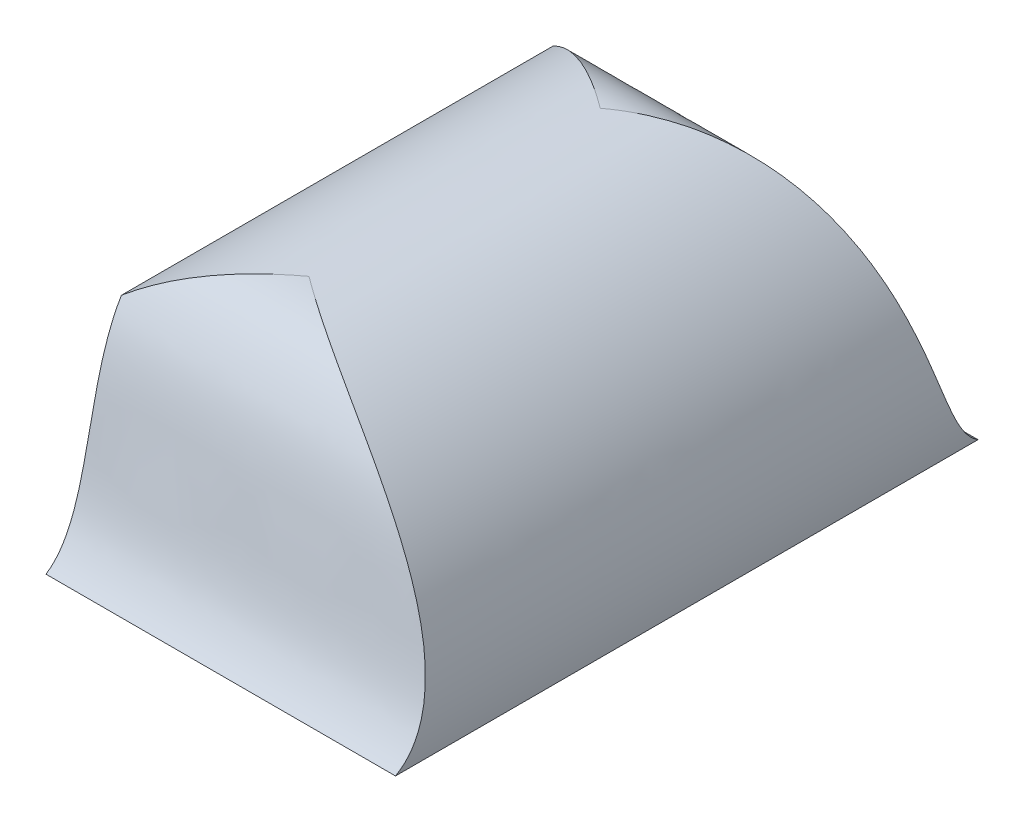
ISO-10303-21;
HEADER;
FILE_DESCRIPTION(('STEP AP214'),'2;1');
FILE_NAME('part.step','',(''),(''),'','','');
FILE_SCHEMA(('AUTOMOTIVE_DESIGN { 1 0 10303 214 1 1 1 1 }'));
ENDSEC;
DATA;
#1=APPLICATION_CONTEXT('core data for automotive mechanical design processes');
#2=APPLICATION_PROTOCOL_DEFINITION('international standard','automotive_design',2000,#1);
#3=PRODUCT_CONTEXT('',#1,'mechanical');
#4=PRODUCT('Part','Part','',(#3));
#5=PRODUCT_RELATED_PRODUCT_CATEGORY('part','',(#4));
#6=PRODUCT_DEFINITION_FORMATION('','',#4);
#7=PRODUCT_DEFINITION_CONTEXT('part definition',#1,'design');
#8=PRODUCT_DEFINITION('design','',#6,#7);
#9=PRODUCT_DEFINITION_SHAPE('','',#8);
#10=(LENGTH_UNIT() NAMED_UNIT(*) SI_UNIT(.MILLI.,.METRE.));
#11=(NAMED_UNIT(*) PLANE_ANGLE_UNIT() SI_UNIT($,.RADIAN.));
#12=(NAMED_UNIT(*) SI_UNIT($,.STERADIAN.) SOLID_ANGLE_UNIT());
#13=UNCERTAINTY_MEASURE_WITH_UNIT(LENGTH_MEASURE(1.E-05),#10,'distance_accuracy_value','');
#14=(GEOMETRIC_REPRESENTATION_CONTEXT(3) GLOBAL_UNCERTAINTY_ASSIGNED_CONTEXT((#13)) GLOBAL_UNIT_ASSIGNED_CONTEXT((#10,
#11,#12)) REPRESENTATION_CONTEXT('',''));
#15=CARTESIAN_POINT('',(0.,0.,0.));
#16=DIRECTION('',(0.,0.,1.));
#17=DIRECTION('',(1.,0.,0.));
#18=AXIS2_PLACEMENT_3D('',#15,#16,#17);
#19=CARTESIAN_POINT('',(0.6,0.,0.25));
#20=CARTESIAN_POINT('',(0.626819788030723,0.289928397578695,0.25));
#21=CARTESIAN_POINT('',(0.257985515738042,0.545390799762338,0.25));
#22=CARTESIAN_POINT('',(0.,0.35,0.25));
#23=B_SPLINE_CURVE_WITH_KNOTS('',3,(#19,#20,#21,#22),.UNSPECIFIED.,.F.,.F.,(4,4),(0.,1.),.UNSPECIFIED.);
#24=DIRECTION('',(0.,0.,-1.));
#25=VECTOR('',#24,1.);
#26=SURFACE_OF_LINEAR_EXTRUSION('',#23,#25);
#27=DIRECTION('',(0.,0.,-1.));
#28=VECTOR('',#27,1.);
#29=CARTESIAN_POINT('',(0.,0.35,0.25));
#30=LINE('',#29,#28);
#31=CARTESIAN_POINT('',(0.,0.349999999403882,0.370521911412625));
#32=VERTEX_POINT('',#31);
#33=CARTESIAN_POINT('',(0.,0.35,-0.370521911412625));
#34=VERTEX_POINT('',#33);
#35=EDGE_CURVE('E48',#32,#34,#30,.T.);
#36=ORIENTED_EDGE('',*,*,#35,.F.);
#37=CARTESIAN_POINT('',(0.,0.349999999999997,0.370521911049339));
#38=CARTESIAN_POINT('',(0.00825527885618861,0.356255849450693,0.366712872777325));
#39=CARTESIAN_POINT('',(0.01670774569311,0.362105432406488,0.362678678142125));
#40=CARTESIAN_POINT('',(0.0339234244274184,0.372950656876308,0.354163679151032));
#41=CARTESIAN_POINT('',(0.0426864991470208,0.377946669826716,0.349683070405773));
#42=CARTESIAN_POINT('',(0.0692006872566339,0.391535029749839,0.335639015499935));
#43=CARTESIAN_POINT('',(0.0872968181289452,0.398817946316962,0.325418908973627));
#44=CARTESIAN_POINT('',(0.121098640930965,0.409136187235741,0.305036802703458));
#45=CARTESIAN_POINT('',(0.136788344406358,0.412620049119834,0.29506273608286));
#46=CARTESIAN_POINT('',(0.167911899364637,0.417252919245855,0.274235900732327));
#47=CARTESIAN_POINT('',(0.183345927724373,0.418403614738341,0.263383772890552));
#48=CARTESIAN_POINT('',(0.199505616780379,0.418544612505018,0.251466641467701));
#49=CARTESIAN_POINT('',(0.2004959868034,0.418548912358348,0.250734018721069));
#50=CARTESIAN_POINT('',(0.20148518074984,0.418548901834156,0.25));
#51=B_SPLINE_CURVE_WITH_KNOTS('',3,(#37,#38,#39,#40,#41,#42,#43,#44,#45,#46,#47,#48,#49,#50),
.UNSPECIFIED.,.F.,.F.,(4,2,2,2,2,2,4),(0.,0.0330862202839932,0.0661580060149827,
0.131829646521694,0.188407274208213,0.244943972653786,0.248639634344501),.UNSPECIFIED.);
#52=CARTESIAN_POINT('',(0.201485180749996,0.418548901834156,0.25));
#53=VERTEX_POINT('',#52);
#54=EDGE_CURVE('E77',#32,#53,#51,.T.);
#55=ORIENTED_EDGE('',*,*,#54,.T.);
#56=CARTESIAN_POINT('',(0.6,0.,0.5));
#57=CARTESIAN_POINT('',(0.600309456843271,0.00328595093172608,0.494965112052997));
#58=CARTESIAN_POINT('',(0.600610500159222,0.00713623887497123,0.490374210968532));
#59=CARTESIAN_POINT('',(0.601089507162062,0.0155632954519763,0.482064447642185));
#60=CARTESIAN_POINT('',(0.601269609789353,0.0201255775204056,0.47833124373096));
#61=CARTESIAN_POINT('',(0.601454954538251,0.0320253042292035,0.469911865294647));
#62=CARTESIAN_POINT('',(0.601334354444628,0.0396417637507074,0.465631526865669));
#63=CARTESIAN_POINT('',(0.600497506607325,0.0553849172072791,0.458063979399536));
#64=CARTESIAN_POINT('',(0.599775335927399,0.0635159388713859,0.454787090636494));
#65=CARTESIAN_POINT('',(0.596748385181316,0.0872787410461483,0.446276502410716));
#66=CARTESIAN_POINT('',(0.593605748882381,0.103113037235993,0.441914948246667));
#67=CARTESIAN_POINT('',(0.5850967919933,0.134370708740922,0.43422445179017));
#68=CARTESIAN_POINT('',(0.579731364935154,0.149794246526878,0.430895095507223));
#69=CARTESIAN_POINT('',(0.564450389619757,0.185923664821895,0.423273653674747));
#70=CARTESIAN_POINT('',(0.553572727417092,0.206259340928663,0.419132877391412));
#71=CARTESIAN_POINT('',(0.528627154892707,0.244755632950418,0.410362891631758));
#72=CARTESIAN_POINT('',(0.514555513806971,0.262913667032004,0.405733114380721));
#73=CARTESIAN_POINT('',(0.483760308356701,0.296816735105153,0.395298023187908));
#74=CARTESIAN_POINT('',(0.467009350638104,0.312533119150924,0.389480372983261));
#75=CARTESIAN_POINT('',(0.431674713054268,0.34095582958504,0.376272103483193));
#76=CARTESIAN_POINT('',(0.413091112238233,0.353662285723215,0.368881552017362));
#77=CARTESIAN_POINT('',(0.37410456686757,0.37618621593128,0.351965538274795));
#78=CARTESIAN_POINT('',(0.353659961186571,0.385881205949137,0.342371952666841));
#79=CARTESIAN_POINT('',(0.312432573313025,0.401528263512743,0.321154569651431));
#80=CARTESIAN_POINT('',(0.291650113315865,0.407483704514568,0.309532614173704));
#81=CARTESIAN_POINT('',(0.248455423708947,0.416086356109303,0.283111456839611));
#82=CARTESIAN_POINT('',(0.226085830064731,0.418347151703636,0.268111510903899));
#83=CARTESIAN_POINT('',(0.203465071608549,0.418544642715857,0.251466128242887));
#84=CARTESIAN_POINT('',(0.202474322305935,0.418548944688426,0.250734015315585));
#85=CARTESIAN_POINT('',(0.20148518074984,0.418548901834156,0.25));
#86=B_SPLINE_CURVE_WITH_KNOTS('',3,(#56,#57,#58,#59,#60,#61,#62,#63,#64,#65,#66,#67,#68,#69,#70,
#71,#72,#73,#74,#75,#76,#77,#78,#79,#80,#81,#82,#83,#84,#85),.UNSPECIFIED.,.F.,.F.,(4,2,2,2,2,2,
2,2,2,2,2,2,2,2,4),(0.,0.0179271297373814,0.0355282081543646,0.0615987211301575,
0.0879289952653558,0.137815573256445,0.187682116942603,0.257603420179295,0.327606819977274,
0.398378012167399,0.469146153047947,0.542499334026183,0.615786247498508,0.696337234710239,
0.700032899617386),.UNSPECIFIED.);
#87=CARTESIAN_POINT('',(0.6,0.,0.5));
#88=VERTEX_POINT('',#87);
#89=EDGE_CURVE('E79',#53,#88,#86,.F.);
#90=ORIENTED_EDGE('',*,*,#89,.T.);
#91=DIRECTION('',(0.,0.,-1.));
#92=VECTOR('',#91,1.);
#93=CARTESIAN_POINT('',(0.6,0.,0.25));
#94=LINE('',#93,#92);
#95=CARTESIAN_POINT('',(0.6,0.,-0.5));
#96=VERTEX_POINT('',#95);
#97=EDGE_CURVE('E89',#88,#96,#94,.T.);
#98=ORIENTED_EDGE('',*,*,#97,.T.);
#99=CARTESIAN_POINT('',(0.6,0.,-0.5));
#100=CARTESIAN_POINT('',(0.600309456843271,0.00328595093172607,-0.494965112052997));
#101=CARTESIAN_POINT('',(0.600610500159222,0.00713623887497124,-0.490374210968532));
#102=CARTESIAN_POINT('',(0.601089507162062,0.0155632954519763,-0.482064447642185));
#103=CARTESIAN_POINT('',(0.601269609789353,0.0201255775204056,-0.47833124373096));
#104=CARTESIAN_POINT('',(0.601454954538251,0.0320253042292035,-0.469911865294647));
#105=CARTESIAN_POINT('',(0.601334354444628,0.0396417637507074,-0.465631526865669));
#106=CARTESIAN_POINT('',(0.600497506607325,0.0553849172072791,-0.458063979399536));
#107=CARTESIAN_POINT('',(0.5997753359274,0.0635159388713859,-0.454787090636494));
#108=CARTESIAN_POINT('',(0.596748385181316,0.0872787410461483,-0.446276502410716));
#109=CARTESIAN_POINT('',(0.593605748882381,0.103113037235993,-0.441914948246667));
#110=CARTESIAN_POINT('',(0.585096791993299,0.134370708740922,-0.43422445179017));
#111=CARTESIAN_POINT('',(0.579731364935154,0.149794246526878,-0.430895095507223));
#112=CARTESIAN_POINT('',(0.564450389619757,0.185923664821896,-0.423273653674747));
#113=CARTESIAN_POINT('',(0.553572727417092,0.206259340928664,-0.419132877391411));
#114=CARTESIAN_POINT('',(0.528627154892706,0.244755632950419,-0.410362891631758));
#115=CARTESIAN_POINT('',(0.51455551380697,0.262913667032004,-0.40573311438072));
#116=CARTESIAN_POINT('',(0.4837603083567,0.296816735105154,-0.395298023187908));
#117=CARTESIAN_POINT('',(0.467009350638103,0.312533119150925,-0.389480372983261));
#118=CARTESIAN_POINT('',(0.431674713054267,0.340955829585041,-0.376272103483192));
#119=CARTESIAN_POINT('',(0.413091112238231,0.353662285723216,-0.368881552017362));
#120=CARTESIAN_POINT('',(0.374104566867568,0.376186215931281,-0.351965538274795));
#121=CARTESIAN_POINT('',(0.353659961186569,0.385881205949137,-0.342371952666839));
#122=CARTESIAN_POINT('',(0.312432573313022,0.401528263512743,-0.321154569651431));
#123=CARTESIAN_POINT('',(0.291650113315862,0.407483704514568,-0.309532614173706));
#124=CARTESIAN_POINT('',(0.248455423708948,0.416086356109303,-0.283111456839608));
#125=CARTESIAN_POINT('',(0.226085830064738,0.418347151703636,-0.268111510903888));
#126=CARTESIAN_POINT('',(0.203465071608549,0.418544642715857,-0.251466128242886));
#127=CARTESIAN_POINT('',(0.202474322305935,0.418548944688426,-0.250734015315584));
#128=CARTESIAN_POINT('',(0.20148518074984,0.418548901834156,-0.25));
#129=B_SPLINE_CURVE_WITH_KNOTS('',3,(#99,#100,#101,#102,#103,#104,#105,#106,#107,#108,#109,#110,
#111,#112,#113,#114,#115,#116,#117,#118,#119,#120,#121,#122,#123,#124,#125,#126,#127,#128),
.UNSPECIFIED.,.F.,.F.,(4,2,2,2,2,2,2,2,2,2,2,2,2,2,4),(0.,0.0179271297373815,0.0355282081543646,
0.0615987211301575,0.0879289952653557,0.137815573256446,0.187682116942604,0.257603420179296,
0.327606819977276,0.3983780121674,0.469146153047948,0.542499334026186,0.615786247498509,
0.696337234710239,0.700032899617385),.UNSPECIFIED.);
#130=CARTESIAN_POINT('',(0.201486085555685,0.418548901832957,-0.25));
#131=VERTEX_POINT('',#130);
#132=EDGE_CURVE('E121',#131,#96,#129,.F.);
#133=ORIENTED_EDGE('',*,*,#132,.F.);
#134=CARTESIAN_POINT('',(0.,0.349999999999997,-0.370521911049339));
#135=CARTESIAN_POINT('',(0.00825527885619393,0.356255849450697,-0.366712872777322));
#136=CARTESIAN_POINT('',(0.0167077456931216,0.362105432406496,-0.362678678142119));
#137=CARTESIAN_POINT('',(0.0339234244274423,0.372950656876322,-0.354163679151021));
#138=CARTESIAN_POINT('',(0.0426864991470509,0.377946669826733,-0.349683070405758));
#139=CARTESIAN_POINT('',(0.0692006872566738,0.391535029749857,-0.335639015499912));
#140=CARTESIAN_POINT('',(0.087296818128987,0.398817946316979,-0.325418908973595));
#141=CARTESIAN_POINT('',(0.121098640931009,0.409136187235751,-0.305036802703437));
#142=CARTESIAN_POINT('',(0.136788344406402,0.412620049119839,-0.295062736082856));
#143=CARTESIAN_POINT('',(0.16791189936464,0.417252919245856,-0.2742359007323));
#144=CARTESIAN_POINT('',(0.183345927724335,0.418403614738342,-0.263383772890485));
#145=CARTESIAN_POINT('',(0.199505616780374,0.418544612505018,-0.251466641467692));
#146=CARTESIAN_POINT('',(0.200495986803397,0.418548912358348,-0.250734018721065));
#147=CARTESIAN_POINT('',(0.20148518074984,0.418548901834156,-0.25));
#148=B_SPLINE_CURVE_WITH_KNOTS('',3,(#134,#135,#136,#137,#138,#139,#140,#141,#142,#143,#144,
#145,#146,#147),.UNSPECIFIED.,.F.,.F.,(4,2,2,2,2,2,4),(0.,0.0330862202840161,0.0661580060150272,
0.131829646521755,0.18840727420824,0.244943972653787,0.2486396343445),.UNSPECIFIED.);
#149=EDGE_CURVE('E11',#34,#131,#148,.T.);
#150=ORIENTED_EDGE('',*,*,#149,.F.);
#151=EDGE_LOOP('',(#36,#55,#90,#98,#133,#150));
#152=FACE_BOUND('',#151,.T.);
#153=ADVANCED_FACE('F34',(#152),#26,.F.);
#154=CARTESIAN_POINT('',(0.,0.35,0.25));
#155=DIRECTION('',(1.,0.,0.));
#156=DIRECTION('',(0.,1.,0.));
#157=AXIS2_PLACEMENT_3D('',#154,#155,#156);
#158=PLANE('',#157);
#159=CARTESIAN_POINT('',(0.,0.,0.5));
#160=CARTESIAN_POINT('',(0.,0.0714905444473845,0.390864989579389));
#161=CARTESIAN_POINT('',(0.,0.418548901834156,0.458561006871926));
#162=CARTESIAN_POINT('',(0.,0.418548901834156,0.25));
#163=B_SPLINE_CURVE_WITH_KNOTS('',3,(#159,#160,#161,#162),.UNSPECIFIED.,.F.,.F.,(4,4),(0.,1.),.UNSPECIFIED.);
#164=CARTESIAN_POINT('',(0.,0.,0.5));
#165=VERTEX_POINT('',#164);
#166=EDGE_CURVE('E93',#165,#32,#163,.T.);
#167=ORIENTED_EDGE('',*,*,#166,.T.);
#168=ORIENTED_EDGE('',*,*,#35,.T.);
#169=CARTESIAN_POINT('',(0.,0.,-0.5));
#170=CARTESIAN_POINT('',(0.,0.0714905444473845,-0.390864989579389));
#171=CARTESIAN_POINT('',(0.,0.418548901834156,-0.458561006871926));
#172=CARTESIAN_POINT('',(0.,0.418548901834156,-0.25));
#173=B_SPLINE_CURVE_WITH_KNOTS('',3,(#169,#170,#171,#172),.UNSPECIFIED.,.F.,.F.,(4,4),(0.,1.),.UNSPECIFIED.);
#174=CARTESIAN_POINT('',(0.,0.,-0.5));
#175=VERTEX_POINT('',#174);
#176=EDGE_CURVE('E84',#175,#34,#173,.T.);
#177=ORIENTED_EDGE('',*,*,#176,.F.);
#178=DIRECTION('',(0.,0.,-1.));
#179=VECTOR('',#178,1.);
#180=CARTESIAN_POINT('',(0.,0.,0.25));
#181=LINE('',#180,#179);
#182=EDGE_CURVE('E91',#165,#175,#181,.T.);
#183=ORIENTED_EDGE('',*,*,#182,.F.);
#184=EDGE_LOOP('',(#167,#168,#177,#183));
#185=FACE_BOUND('',#184,.T.);
#186=ADVANCED_FACE('F142',(#185),#158,.F.);
#187=CARTESIAN_POINT('',(0.,0.,0.25));
#188=DIRECTION('',(0.,1.,0.));
#189=DIRECTION('',(0.,0.,1.));
#190=AXIS2_PLACEMENT_3D('',#187,#188,#189);
#191=PLANE('',#190);
#192=ORIENTED_EDGE('',*,*,#182,.T.);
#193=DIRECTION('',(-1.,0.,0.));
#194=VECTOR('',#193,1.);
#195=CARTESIAN_POINT('',(0.627446635869675,0.,-0.5));
#196=LINE('',#195,#194);
#197=EDGE_CURVE('E102',#96,#175,#196,.T.);
#198=ORIENTED_EDGE('',*,*,#197,.F.);
#199=ORIENTED_EDGE('',*,*,#97,.F.);
#200=DIRECTION('',(-1.,0.,0.));
#201=VECTOR('',#200,1.);
#202=CARTESIAN_POINT('',(0.614409894015362,0.,0.5));
#203=LINE('',#202,#201);
#204=EDGE_CURVE('E88',#88,#165,#203,.T.);
#205=ORIENTED_EDGE('',*,*,#204,.T.);
#206=EDGE_LOOP('',(#192,#198,#199,#205));
#207=FACE_BOUND('',#206,.T.);
#208=ADVANCED_FACE('F112',(#207),#191,.F.);
#209=CARTESIAN_POINT('',(0.614409894015362,0.,0.5));
#210=CARTESIAN_POINT('',(0.614409894015362,0.0714905444473845,0.390864989579389));
#211=CARTESIAN_POINT('',(0.614409894015362,0.418548901834156,0.458561006871926));
#212=CARTESIAN_POINT('',(0.614409894015362,0.418548901834156,0.25));
#213=B_SPLINE_CURVE_WITH_KNOTS('',3,(#209,#210,#211,#212),.UNSPECIFIED.,.F.,.F.,(4,4),(0.,1.),.UNSPECIFIED.);
#214=DIRECTION('',(-1.,0.,0.));
#215=VECTOR('',#214,1.);
#216=SURFACE_OF_LINEAR_EXTRUSION('',#213,#215);
#217=ORIENTED_EDGE('',*,*,#54,.F.);
#218=ORIENTED_EDGE('',*,*,#166,.F.);
#219=ORIENTED_EDGE('',*,*,#204,.F.);
#220=ORIENTED_EDGE('',*,*,#89,.F.);
#221=EDGE_LOOP('',(#217,#218,#219,#220));
#222=FACE_BOUND('',#221,.T.);
#223=ADVANCED_FACE('F86',(#222),#216,.T.);
#224=CARTESIAN_POINT('',(0.627446635869675,0.,-0.5));
#225=CARTESIAN_POINT('',(0.627446635869675,0.0714905444473845,-0.390864989579389));
#226=CARTESIAN_POINT('',(0.627446635869675,0.418548901834156,-0.458561006871926));
#227=CARTESIAN_POINT('',(0.627446635869675,0.418548901834156,-0.25));
#228=B_SPLINE_CURVE_WITH_KNOTS('',3,(#224,#225,#226,#227),.UNSPECIFIED.,.F.,.F.,(4,4),(0.,1.),.UNSPECIFIED.);
#229=DIRECTION('',(-1.,0.,0.));
#230=VECTOR('',#229,1.);
#231=SURFACE_OF_LINEAR_EXTRUSION('',#228,#230);
#232=ORIENTED_EDGE('',*,*,#176,.T.);
#233=ORIENTED_EDGE('',*,*,#149,.T.);
#234=ORIENTED_EDGE('',*,*,#132,.T.);
#235=ORIENTED_EDGE('',*,*,#197,.T.);
#236=EDGE_LOOP('',(#232,#233,#234,#235));
#237=FACE_BOUND('',#236,.T.);
#238=ADVANCED_FACE('F111',(#237),#231,.F.);
#239=CLOSED_SHELL('',(#153,#186,#208,#223,#238));
#240=MANIFOLD_SOLID_BREP('B2',#239);
#241=ADVANCED_BREP_SHAPE_REPRESENTATION('',(#18,#240),#14);
#242=SHAPE_DEFINITION_REPRESENTATION(#9,#241);
ENDSEC;
END-ISO-10303-21;
